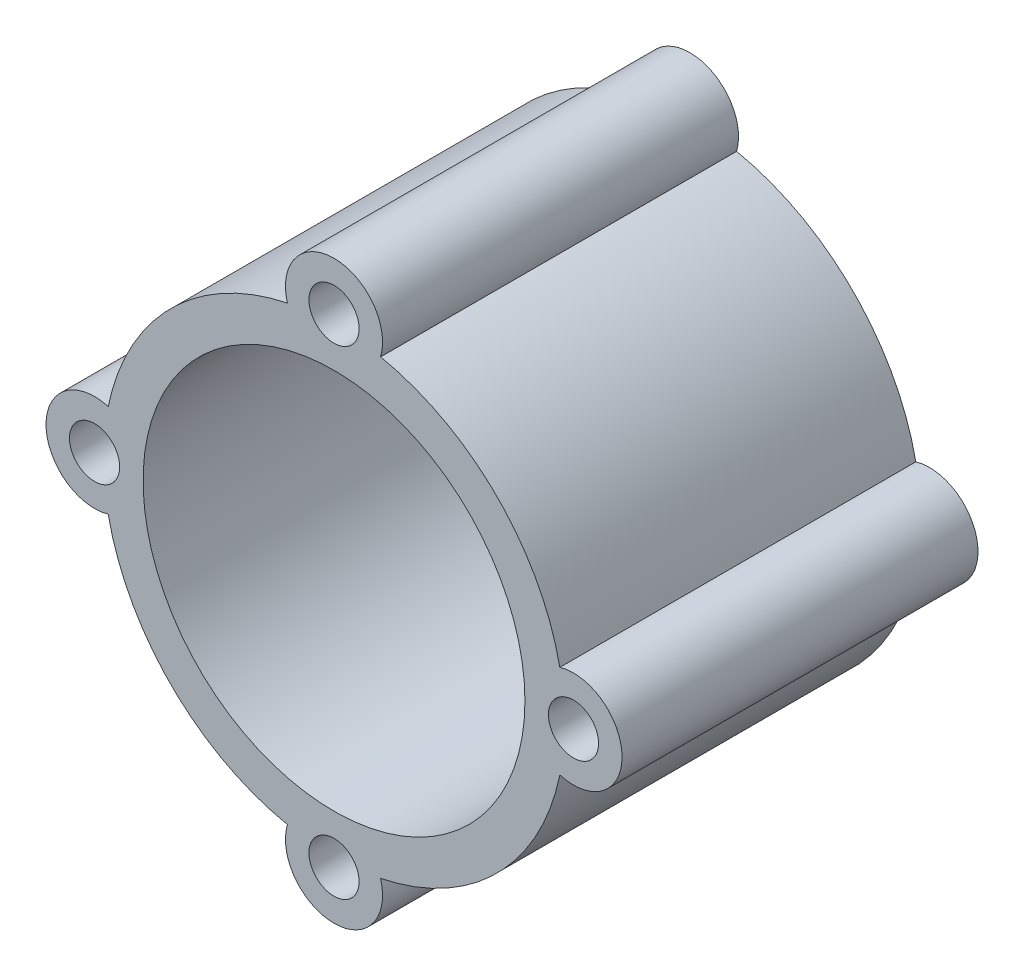
ISO-10303-21;
HEADER;
FILE_DESCRIPTION(('STEP AP214'),'2;1');
FILE_NAME('part.step','',(''),(''),'','','');
FILE_SCHEMA(('AUTOMOTIVE_DESIGN { 1 0 10303 214 1 1 1 1 }'));
ENDSEC;
DATA;
#1=APPLICATION_CONTEXT('core data for automotive mechanical design processes');
#2=APPLICATION_PROTOCOL_DEFINITION('international standard','automotive_design',2000,#1);
#3=PRODUCT_CONTEXT('',#1,'mechanical');
#4=PRODUCT('Part','Part','',(#3));
#5=PRODUCT_RELATED_PRODUCT_CATEGORY('part','',(#4));
#6=PRODUCT_DEFINITION_FORMATION('','',#4);
#7=PRODUCT_DEFINITION_CONTEXT('part definition',#1,'design');
#8=PRODUCT_DEFINITION('design','',#6,#7);
#9=PRODUCT_DEFINITION_SHAPE('','',#8);
#10=(LENGTH_UNIT() NAMED_UNIT(*) SI_UNIT(.MILLI.,.METRE.));
#11=(NAMED_UNIT(*) PLANE_ANGLE_UNIT() SI_UNIT($,.RADIAN.));
#12=(NAMED_UNIT(*) SI_UNIT($,.STERADIAN.) SOLID_ANGLE_UNIT());
#13=UNCERTAINTY_MEASURE_WITH_UNIT(LENGTH_MEASURE(1.E-05),#10,'distance_accuracy_value','');
#14=(GEOMETRIC_REPRESENTATION_CONTEXT(3) GLOBAL_UNCERTAINTY_ASSIGNED_CONTEXT((#13)) GLOBAL_UNIT_ASSIGNED_CONTEXT((#10,
#11,#12)) REPRESENTATION_CONTEXT('',''));
#15=CARTESIAN_POINT('',(0.,0.,0.));
#16=DIRECTION('',(0.,0.,1.));
#17=DIRECTION('',(1.,0.,0.));
#18=AXIS2_PLACEMENT_3D('',#15,#16,#17);
#19=CARTESIAN_POINT('',(0.,0.,44.));
#20=DIRECTION('',(0.,0.,-1.));
#21=DIRECTION('',(-1.,0.,0.));
#22=AXIS2_PLACEMENT_3D('',#19,#20,#21);
#23=CYLINDRICAL_SURFACE('',#22,28.5);
#24=CARTESIAN_POINT('',(0.,0.,0.));
#25=DIRECTION('',(0.,0.,1.));
#26=DIRECTION('',(1.,0.,0.));
#27=AXIS2_PLACEMENT_3D('',#24,#25,#26);
#28=CIRCLE('',#27,28.5);
#29=CARTESIAN_POINT('',(5.75775769029033,-27.9123310810814,0.));
#30=VERTEX_POINT('',#29);
#31=CARTESIAN_POINT('',(27.9123310810809,-5.75775769029285,0.));
#32=VERTEX_POINT('',#31);
#33=EDGE_CURVE('E112',#30,#32,#28,.T.);
#34=ORIENTED_EDGE('',*,*,#33,.T.);
#35=DIRECTION('',(0.,0.,-1.));
#36=VECTOR('',#35,1.);
#37=CARTESIAN_POINT('',(27.9123310810809,-5.75775769029285,22.));
#38=LINE('',#37,#36);
#39=CARTESIAN_POINT('',(27.9123310810809,-5.75775769029285,44.));
#40=VERTEX_POINT('',#39);
#41=EDGE_CURVE('E98',#32,#40,#38,.F.);
#42=ORIENTED_EDGE('',*,*,#41,.T.);
#43=CARTESIAN_POINT('',(0.,0.,44.));
#44=DIRECTION('',(0.,0.,1.));
#45=DIRECTION('',(1.,0.,0.));
#46=AXIS2_PLACEMENT_3D('',#43,#44,#45);
#47=CIRCLE('',#46,28.5);
#48=CARTESIAN_POINT('',(5.75775769029033,-27.9123310810814,44.));
#49=VERTEX_POINT('',#48);
#50=EDGE_CURVE('E132',#49,#40,#47,.T.);
#51=ORIENTED_EDGE('',*,*,#50,.F.);
#52=DIRECTION('',(0.,0.,-1.));
#53=VECTOR('',#52,1.);
#54=CARTESIAN_POINT('',(5.75775769029033,-27.9123310810814,22.));
#55=LINE('',#54,#53);
#56=EDGE_CURVE('E117',#49,#30,#55,.T.);
#57=ORIENTED_EDGE('',*,*,#56,.T.);
#58=EDGE_LOOP('',(#34,#42,#51,#57));
#59=FACE_BOUND('',#58,.T.);
#60=ADVANCED_FACE('F33',(#59),#23,.T.);
#61=CARTESIAN_POINT('',(-27.9123310810813,-5.75775769029087,0.));
#62=VERTEX_POINT('',#61);
#63=CARTESIAN_POINT('',(-5.75775769029339,-27.9123310810808,0.));
#64=VERTEX_POINT('',#63);
#65=EDGE_CURVE('E118',#62,#64,#28,.T.);
#66=ORIENTED_EDGE('',*,*,#65,.T.);
#67=DIRECTION('',(0.,0.,-1.));
#68=VECTOR('',#67,1.);
#69=CARTESIAN_POINT('',(-5.75775769029339,-27.9123310810808,22.));
#70=LINE('',#69,#68);
#71=CARTESIAN_POINT('',(-5.75775769029339,-27.9123310810808,44.));
#72=VERTEX_POINT('',#71);
#73=EDGE_CURVE('E158',#64,#72,#70,.F.);
#74=ORIENTED_EDGE('',*,*,#73,.T.);
#75=CARTESIAN_POINT('',(-27.9123310810813,-5.75775769029087,44.));
#76=VERTEX_POINT('',#75);
#77=EDGE_CURVE('E42',#76,#72,#47,.T.);
#78=ORIENTED_EDGE('',*,*,#77,.F.);
#79=DIRECTION('',(0.,0.,-1.));
#80=VECTOR('',#79,1.);
#81=CARTESIAN_POINT('',(-27.9123310810813,-5.75775769029088,22.));
#82=LINE('',#81,#80);
#83=EDGE_CURVE('E150',#76,#62,#82,.T.);
#84=ORIENTED_EDGE('',*,*,#83,.T.);
#85=EDGE_LOOP('',(#66,#74,#78,#84));
#86=FACE_BOUND('',#85,.T.);
#87=ADVANCED_FACE('F229',(#86),#23,.T.);
#88=CARTESIAN_POINT('',(-5.75775769029185,27.9123310810811,0.));
#89=VERTEX_POINT('',#88);
#90=CARTESIAN_POINT('',(-27.912331081081,5.7577576902924,0.));
#91=VERTEX_POINT('',#90);
#92=EDGE_CURVE('E37',#89,#91,#28,.T.);
#93=ORIENTED_EDGE('',*,*,#92,.T.);
#94=DIRECTION('',(0.,0.,-1.));
#95=VECTOR('',#94,1.);
#96=CARTESIAN_POINT('',(-27.912331081081,5.7577576902924,22.));
#97=LINE('',#96,#95);
#98=CARTESIAN_POINT('',(-27.912331081081,5.7577576902924,44.));
#99=VERTEX_POINT('',#98);
#100=EDGE_CURVE('E148',#91,#99,#97,.F.);
#101=ORIENTED_EDGE('',*,*,#100,.T.);
#102=CARTESIAN_POINT('',(-5.75775769029186,27.9123310810811,44.));
#103=VERTEX_POINT('',#102);
#104=EDGE_CURVE('E11',#103,#99,#47,.T.);
#105=ORIENTED_EDGE('',*,*,#104,.F.);
#106=DIRECTION('',(0.,0.,-1.));
#107=VECTOR('',#106,1.);
#108=CARTESIAN_POINT('',(-5.75775769029186,27.9123310810811,22.));
#109=LINE('',#108,#107);
#110=EDGE_CURVE('E142',#103,#89,#109,.T.);
#111=ORIENTED_EDGE('',*,*,#110,.T.);
#112=EDGE_LOOP('',(#93,#101,#105,#111));
#113=FACE_BOUND('',#112,.T.);
#114=ADVANCED_FACE('F219',(#113),#23,.T.);
#115=CARTESIAN_POINT('',(0.,0.,44.));
#116=DIRECTION('',(0.,0.,1.));
#117=DIRECTION('',(1.,0.,0.));
#118=AXIS2_PLACEMENT_3D('',#115,#116,#117);
#119=PLANE('',#118);
#120=CARTESIAN_POINT('',(-29.6000000000008,8.09530491390734E-13,44.));
#121=DIRECTION('',(0.,0.,-1.));
#122=DIRECTION('',(-1.,0.,0.));
#123=AXIS2_PLACEMENT_3D('',#120,#121,#122);
#124=CIRCLE('',#123,3.10000000000001);
#125=CARTESIAN_POINT('',(-32.7000000000008,8.09530491390734E-13,44.));
#126=VERTEX_POINT('',#125);
#127=EDGE_CURVE('E170',#126,#126,#124,.T.);
#128=ORIENTED_EDGE('',*,*,#127,.T.);
#129=EDGE_LOOP('',(#128));
#130=FACE_BOUND('',#129,.T.);
#131=CARTESIAN_POINT('',(29.5999999999992,-8.1315544591621E-13,44.));
#132=DIRECTION('',(0.,0.,-1.));
#133=DIRECTION('',(-1.,0.,0.));
#134=AXIS2_PLACEMENT_3D('',#131,#132,#133);
#135=CIRCLE('',#134,3.1);
#136=CARTESIAN_POINT('',(26.4999999999992,-8.1315544591621E-13,44.));
#137=VERTEX_POINT('',#136);
#138=EDGE_CURVE('E182',#137,#137,#135,.T.);
#139=ORIENTED_EDGE('',*,*,#138,.T.);
#140=EDGE_LOOP('',(#139));
#141=FACE_BOUND('',#140,.T.);
#142=CARTESIAN_POINT('',(-1.61893851810155E-12,-29.6,44.));
#143=DIRECTION('',(0.,0.,-1.));
#144=DIRECTION('',(-1.,0.,0.));
#145=AXIS2_PLACEMENT_3D('',#142,#143,#144);
#146=CIRCLE('',#145,3.1);
#147=CARTESIAN_POINT('',(-3.10000000000162,-29.6,44.));
#148=VERTEX_POINT('',#147);
#149=EDGE_CURVE('E176',#148,#148,#146,.T.);
#150=ORIENTED_EDGE('',*,*,#149,.T.);
#151=EDGE_LOOP('',(#150));
#152=FACE_BOUND('',#151,.T.);
#153=CARTESIAN_POINT('',(0.,29.6,44.));
#154=DIRECTION('',(0.,0.,-1.));
#155=DIRECTION('',(-1.,0.,0.));
#156=AXIS2_PLACEMENT_3D('',#153,#154,#155);
#157=CIRCLE('',#156,3.1);
#158=CARTESIAN_POINT('',(-3.1,29.6,44.));
#159=VERTEX_POINT('',#158);
#160=EDGE_CURVE('E115',#159,#159,#157,.T.);
#161=ORIENTED_EDGE('',*,*,#160,.T.);
#162=EDGE_LOOP('',(#161));
#163=FACE_BOUND('',#162,.T.);
#164=CARTESIAN_POINT('',(0.,0.,44.));
#165=DIRECTION('',(0.,0.,1.));
#166=DIRECTION('',(1.,0.,0.));
#167=AXIS2_PLACEMENT_3D('',#164,#165,#166);
#168=CIRCLE('',#167,23.6);
#169=CARTESIAN_POINT('',(23.6,0.,44.));
#170=VERTEX_POINT('',#169);
#171=EDGE_CURVE('E120',#170,#170,#168,.T.);
#172=ORIENTED_EDGE('',*,*,#171,.F.);
#173=EDGE_LOOP('',(#172));
#174=FACE_BOUND('',#173,.T.);
#175=CARTESIAN_POINT('',(29.5999999999992,-8.1315544591621E-13,44.));
#176=DIRECTION('',(0.,0.,1.));
#177=DIRECTION('',(1.,0.,0.));
#178=AXIS2_PLACEMENT_3D('',#175,#176,#177);
#179=CIRCLE('',#178,6.);
#180=CARTESIAN_POINT('',(27.9123310810812,5.75775769029132,44.));
#181=VERTEX_POINT('',#180);
#182=EDGE_CURVE('E101',#181,#40,#179,.F.);
#183=ORIENTED_EDGE('',*,*,#182,.F.);
#184=CARTESIAN_POINT('',(5.75775769029186,27.9123310810811,44.));
#185=VERTEX_POINT('',#184);
#186=EDGE_CURVE('E43',#181,#185,#47,.T.);
#187=ORIENTED_EDGE('',*,*,#186,.T.);
#188=CARTESIAN_POINT('',(0.,29.6,44.));
#189=DIRECTION('',(0.,0.,1.));
#190=DIRECTION('',(1.,0.,0.));
#191=AXIS2_PLACEMENT_3D('',#188,#189,#190);
#192=CIRCLE('',#191,6.);
#193=EDGE_CURVE('E144',#103,#185,#192,.F.);
#194=ORIENTED_EDGE('',*,*,#193,.F.);
#195=ORIENTED_EDGE('',*,*,#104,.T.);
#196=CARTESIAN_POINT('',(-29.6000000000008,8.09530491390734E-13,44.));
#197=DIRECTION('',(0.,0.,1.));
#198=DIRECTION('',(1.,0.,0.));
#199=AXIS2_PLACEMENT_3D('',#196,#197,#198);
#200=CIRCLE('',#199,6.00000000000001);
#201=EDGE_CURVE('E153',#76,#99,#200,.F.);
#202=ORIENTED_EDGE('',*,*,#201,.F.);
#203=ORIENTED_EDGE('',*,*,#77,.T.);
#204=CARTESIAN_POINT('',(-1.61893851810155E-12,-29.6,44.));
#205=DIRECTION('',(0.,0.,1.));
#206=DIRECTION('',(1.,0.,0.));
#207=AXIS2_PLACEMENT_3D('',#204,#205,#206);
#208=CIRCLE('',#207,6.);
#209=EDGE_CURVE('E162',#49,#72,#208,.F.);
#210=ORIENTED_EDGE('',*,*,#209,.F.);
#211=ORIENTED_EDGE('',*,*,#50,.T.);
#212=EDGE_LOOP('',(#183,#187,#194,#195,#202,#203,#210,#211));
#213=FACE_BOUND('',#212,.T.);
#214=ADVANCED_FACE('F191',(#130,#141,#152,#163,#174,#213),#119,.T.);
#215=CARTESIAN_POINT('',(0.,0.,0.));
#216=DIRECTION('',(0.,0.,1.));
#217=DIRECTION('',(1.,0.,0.));
#218=AXIS2_PLACEMENT_3D('',#215,#216,#217);
#219=PLANE('',#218);
#220=CARTESIAN_POINT('',(-29.6000000000008,8.09530491390734E-13,0.));
#221=DIRECTION('',(0.,0.,-1.));
#222=DIRECTION('',(-1.,0.,0.));
#223=AXIS2_PLACEMENT_3D('',#220,#221,#222);
#224=CIRCLE('',#223,3.10000000000001);
#225=CARTESIAN_POINT('',(-32.7000000000008,8.09530491390734E-13,0.));
#226=VERTEX_POINT('',#225);
#227=EDGE_CURVE('E185',#226,#226,#224,.T.);
#228=ORIENTED_EDGE('',*,*,#227,.F.);
#229=EDGE_LOOP('',(#228));
#230=FACE_BOUND('',#229,.T.);
#231=CARTESIAN_POINT('',(29.5999999999992,-8.1315544591621E-13,0.));
#232=DIRECTION('',(0.,0.,-1.));
#233=DIRECTION('',(-1.,0.,0.));
#234=AXIS2_PLACEMENT_3D('',#231,#232,#233);
#235=CIRCLE('',#234,3.1);
#236=CARTESIAN_POINT('',(26.4999999999992,-8.1315544591621E-13,0.));
#237=VERTEX_POINT('',#236);
#238=EDGE_CURVE('E179',#237,#237,#235,.T.);
#239=ORIENTED_EDGE('',*,*,#238,.F.);
#240=EDGE_LOOP('',(#239));
#241=FACE_BOUND('',#240,.T.);
#242=CARTESIAN_POINT('',(-1.61893851810155E-12,-29.6,0.));
#243=DIRECTION('',(0.,0.,-1.));
#244=DIRECTION('',(-1.,0.,0.));
#245=AXIS2_PLACEMENT_3D('',#242,#243,#244);
#246=CIRCLE('',#245,3.1);
#247=CARTESIAN_POINT('',(-3.10000000000162,-29.6,0.));
#248=VERTEX_POINT('',#247);
#249=EDGE_CURVE('E173',#248,#248,#246,.T.);
#250=ORIENTED_EDGE('',*,*,#249,.F.);
#251=EDGE_LOOP('',(#250));
#252=FACE_BOUND('',#251,.T.);
#253=CARTESIAN_POINT('',(0.,29.6,0.));
#254=DIRECTION('',(0.,0.,-1.));
#255=DIRECTION('',(-1.,0.,0.));
#256=AXIS2_PLACEMENT_3D('',#253,#254,#255);
#257=CIRCLE('',#256,3.1);
#258=CARTESIAN_POINT('',(-3.1,29.6,0.));
#259=VERTEX_POINT('',#258);
#260=EDGE_CURVE('E167',#259,#259,#257,.T.);
#261=ORIENTED_EDGE('',*,*,#260,.F.);
#262=EDGE_LOOP('',(#261));
#263=FACE_BOUND('',#262,.T.);
#264=CARTESIAN_POINT('',(0.,0.,0.));
#265=DIRECTION('',(0.,0.,1.));
#266=DIRECTION('',(1.,0.,0.));
#267=AXIS2_PLACEMENT_3D('',#264,#265,#266);
#268=CIRCLE('',#267,23.6);
#269=CARTESIAN_POINT('',(23.6,0.,0.));
#270=VERTEX_POINT('',#269);
#271=EDGE_CURVE('E125',#270,#270,#268,.T.);
#272=ORIENTED_EDGE('',*,*,#271,.T.);
#273=EDGE_LOOP('',(#272));
#274=FACE_BOUND('',#273,.T.);
#275=CARTESIAN_POINT('',(27.9123310810812,5.75775769029132,0.));
#276=VERTEX_POINT('',#275);
#277=CARTESIAN_POINT('',(5.75775769029186,27.9123310810811,0.));
#278=VERTEX_POINT('',#277);
#279=EDGE_CURVE('E114',#276,#278,#28,.T.);
#280=ORIENTED_EDGE('',*,*,#279,.F.);
#281=CARTESIAN_POINT('',(29.5999999999992,-8.1315544591621E-13,0.));
#282=DIRECTION('',(0.,0.,-1.));
#283=DIRECTION('',(-1.,0.,0.));
#284=AXIS2_PLACEMENT_3D('',#281,#282,#283);
#285=CIRCLE('',#284,6.);
#286=EDGE_CURVE('E50',#276,#32,#285,.T.);
#287=ORIENTED_EDGE('',*,*,#286,.T.);
#288=ORIENTED_EDGE('',*,*,#33,.F.);
#289=CARTESIAN_POINT('',(-1.61893851810155E-12,-29.6,0.));
#290=DIRECTION('',(0.,0.,-1.));
#291=DIRECTION('',(-1.,0.,0.));
#292=AXIS2_PLACEMENT_3D('',#289,#290,#291);
#293=CIRCLE('',#292,6.);
#294=EDGE_CURVE('E58',#30,#64,#293,.T.);
#295=ORIENTED_EDGE('',*,*,#294,.T.);
#296=ORIENTED_EDGE('',*,*,#65,.F.);
#297=CARTESIAN_POINT('',(-29.6000000000008,8.09530491390734E-13,0.));
#298=DIRECTION('',(0.,0.,-1.));
#299=DIRECTION('',(-1.,0.,0.));
#300=AXIS2_PLACEMENT_3D('',#297,#298,#299);
#301=CIRCLE('',#300,6.00000000000001);
#302=EDGE_CURVE('E155',#62,#91,#301,.T.);
#303=ORIENTED_EDGE('',*,*,#302,.T.);
#304=ORIENTED_EDGE('',*,*,#92,.F.);
#305=CARTESIAN_POINT('',(0.,29.6,0.));
#306=DIRECTION('',(0.,0.,-1.));
#307=DIRECTION('',(-1.,0.,0.));
#308=AXIS2_PLACEMENT_3D('',#305,#306,#307);
#309=CIRCLE('',#308,6.);
#310=EDGE_CURVE('E146',#89,#278,#309,.T.);
#311=ORIENTED_EDGE('',*,*,#310,.T.);
#312=EDGE_LOOP('',(#280,#287,#288,#295,#296,#303,#304,#311));
#313=FACE_BOUND('',#312,.T.);
#314=ADVANCED_FACE('F111',(#230,#241,#252,#263,#274,#313),#219,.F.);
#315=ORIENTED_EDGE('',*,*,#186,.F.);
#316=DIRECTION('',(0.,0.,-1.));
#317=VECTOR('',#316,1.);
#318=CARTESIAN_POINT('',(27.9123310810812,5.75775769029132,22.));
#319=LINE('',#318,#317);
#320=EDGE_CURVE('E106',#181,#276,#319,.T.);
#321=ORIENTED_EDGE('',*,*,#320,.T.);
#322=ORIENTED_EDGE('',*,*,#279,.T.);
#323=DIRECTION('',(0.,0.,-1.));
#324=VECTOR('',#323,1.);
#325=CARTESIAN_POINT('',(5.75775769029186,27.9123310810811,22.));
#326=LINE('',#325,#324);
#327=EDGE_CURVE('E139',#278,#185,#326,.F.);
#328=ORIENTED_EDGE('',*,*,#327,.T.);
#329=EDGE_LOOP('',(#315,#321,#322,#328));
#330=FACE_BOUND('',#329,.T.);
#331=ADVANCED_FACE('F35',(#330),#23,.T.);
#332=CARTESIAN_POINT('',(0.,0.,44.));
#333=DIRECTION('',(0.,0.,-1.));
#334=DIRECTION('',(-1.,0.,0.));
#335=AXIS2_PLACEMENT_3D('',#332,#333,#334);
#336=CYLINDRICAL_SURFACE('',#335,23.6);
#337=ORIENTED_EDGE('',*,*,#271,.F.);
#338=EDGE_LOOP('',(#337));
#339=FACE_BOUND('',#338,.T.);
#340=ORIENTED_EDGE('',*,*,#171,.T.);
#341=EDGE_LOOP('',(#340));
#342=FACE_BOUND('',#341,.T.);
#343=ADVANCED_FACE('F211',(#339,#342),#336,.F.);
#344=CARTESIAN_POINT('',(0.,29.6,60.9705627484772));
#345=DIRECTION('',(0.,0.,-1.));
#346=DIRECTION('',(-1.,0.,0.));
#347=AXIS2_PLACEMENT_3D('',#344,#345,#346);
#348=CYLINDRICAL_SURFACE('',#347,6.);
#349=ORIENTED_EDGE('',*,*,#327,.F.);
#350=ORIENTED_EDGE('',*,*,#310,.F.);
#351=ORIENTED_EDGE('',*,*,#110,.F.);
#352=ORIENTED_EDGE('',*,*,#193,.T.);
#353=EDGE_LOOP('',(#349,#350,#351,#352));
#354=FACE_BOUND('',#353,.T.);
#355=ADVANCED_FACE('F214',(#354),#348,.T.);
#356=CARTESIAN_POINT('',(-29.6000000000008,8.09530491390734E-13,60.9705627484772));
#357=DIRECTION('',(0.,0.,-1.));
#358=DIRECTION('',(-1.,0.,0.));
#359=AXIS2_PLACEMENT_3D('',#356,#357,#358);
#360=CYLINDRICAL_SURFACE('',#359,6.00000000000001);
#361=ORIENTED_EDGE('',*,*,#100,.F.);
#362=ORIENTED_EDGE('',*,*,#302,.F.);
#363=ORIENTED_EDGE('',*,*,#83,.F.);
#364=ORIENTED_EDGE('',*,*,#201,.T.);
#365=EDGE_LOOP('',(#361,#362,#363,#364));
#366=FACE_BOUND('',#365,.T.);
#367=ADVANCED_FACE('F225',(#366),#360,.T.);
#368=CARTESIAN_POINT('',(-1.61893851810155E-12,-29.6,60.9705627484772));
#369=DIRECTION('',(0.,0.,-1.));
#370=DIRECTION('',(-1.,0.,0.));
#371=AXIS2_PLACEMENT_3D('',#368,#369,#370);
#372=CYLINDRICAL_SURFACE('',#371,6.);
#373=ORIENTED_EDGE('',*,*,#73,.F.);
#374=ORIENTED_EDGE('',*,*,#294,.F.);
#375=ORIENTED_EDGE('',*,*,#56,.F.);
#376=ORIENTED_EDGE('',*,*,#209,.T.);
#377=EDGE_LOOP('',(#373,#374,#375,#376));
#378=FACE_BOUND('',#377,.T.);
#379=ADVANCED_FACE('F279',(#378),#372,.T.);
#380=CARTESIAN_POINT('',(29.5999999999992,-8.1315544591621E-13,60.9705627484772));
#381=DIRECTION('',(0.,0.,-1.));
#382=DIRECTION('',(-1.,0.,0.));
#383=AXIS2_PLACEMENT_3D('',#380,#381,#382);
#384=CYLINDRICAL_SURFACE('',#383,6.);
#385=ORIENTED_EDGE('',*,*,#41,.F.);
#386=ORIENTED_EDGE('',*,*,#286,.F.);
#387=ORIENTED_EDGE('',*,*,#320,.F.);
#388=ORIENTED_EDGE('',*,*,#182,.T.);
#389=EDGE_LOOP('',(#385,#386,#387,#388));
#390=FACE_BOUND('',#389,.T.);
#391=ADVANCED_FACE('F99',(#390),#384,.T.);
#392=CARTESIAN_POINT('',(0.,29.6,44.));
#393=DIRECTION('',(0.,0.,-1.));
#394=DIRECTION('',(-1.,0.,0.));
#395=AXIS2_PLACEMENT_3D('',#392,#393,#394);
#396=CYLINDRICAL_SURFACE('',#395,3.1);
#397=ORIENTED_EDGE('',*,*,#160,.F.);
#398=EDGE_LOOP('',(#397));
#399=FACE_BOUND('',#398,.T.);
#400=ORIENTED_EDGE('',*,*,#260,.T.);
#401=EDGE_LOOP('',(#400));
#402=FACE_BOUND('',#401,.T.);
#403=ADVANCED_FACE('F296',(#399,#402),#396,.F.);
#404=CARTESIAN_POINT('',(-1.61893851810155E-12,-29.6,44.));
#405=DIRECTION('',(0.,0.,-1.));
#406=DIRECTION('',(-1.,0.,0.));
#407=AXIS2_PLACEMENT_3D('',#404,#405,#406);
#408=CYLINDRICAL_SURFACE('',#407,3.1);
#409=ORIENTED_EDGE('',*,*,#149,.F.);
#410=EDGE_LOOP('',(#409));
#411=FACE_BOUND('',#410,.T.);
#412=ORIENTED_EDGE('',*,*,#249,.T.);
#413=EDGE_LOOP('',(#412));
#414=FACE_BOUND('',#413,.T.);
#415=ADVANCED_FACE('F319',(#411,#414),#408,.F.);
#416=CARTESIAN_POINT('',(29.5999999999992,-8.1315544591621E-13,44.));
#417=DIRECTION('',(0.,0.,-1.));
#418=DIRECTION('',(-1.,0.,0.));
#419=AXIS2_PLACEMENT_3D('',#416,#417,#418);
#420=CYLINDRICAL_SURFACE('',#419,3.1);
#421=ORIENTED_EDGE('',*,*,#138,.F.);
#422=EDGE_LOOP('',(#421));
#423=FACE_BOUND('',#422,.T.);
#424=ORIENTED_EDGE('',*,*,#238,.T.);
#425=EDGE_LOOP('',(#424));
#426=FACE_BOUND('',#425,.T.);
#427=ADVANCED_FACE('F197',(#423,#426),#420,.F.);
#428=CARTESIAN_POINT('',(-29.6000000000008,8.09530491390734E-13,44.));
#429=DIRECTION('',(0.,0.,-1.));
#430=DIRECTION('',(-1.,0.,0.));
#431=AXIS2_PLACEMENT_3D('',#428,#429,#430);
#432=CYLINDRICAL_SURFACE('',#431,3.10000000000001);
#433=ORIENTED_EDGE('',*,*,#127,.F.);
#434=EDGE_LOOP('',(#433));
#435=FACE_BOUND('',#434,.T.);
#436=ORIENTED_EDGE('',*,*,#227,.T.);
#437=EDGE_LOOP('',(#436));
#438=FACE_BOUND('',#437,.T.);
#439=ADVANCED_FACE('F194',(#435,#438),#432,.F.);
#440=CLOSED_SHELL('',(#60,#87,#114,#214,#314,#331,#343,#355,#367,#379,#391,#403,#415,#427,#439));
#441=MANIFOLD_SOLID_BREP('B2',#440);
#442=ADVANCED_BREP_SHAPE_REPRESENTATION('',(#18,#441),#14);
#443=SHAPE_DEFINITION_REPRESENTATION(#9,#442);
ENDSEC;
END-ISO-10303-21;
